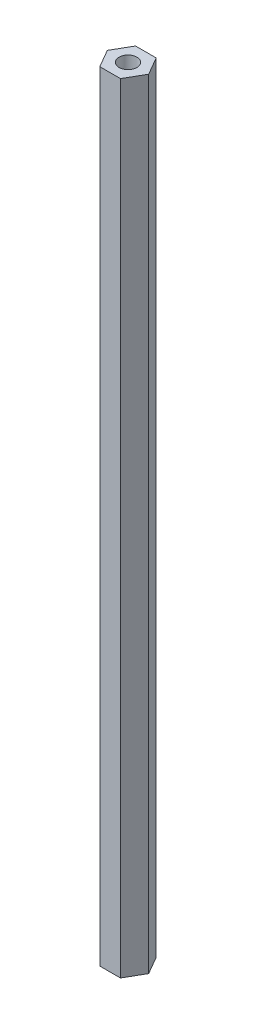
ISO-10303-21;
HEADER;
FILE_DESCRIPTION(('STEP AP214'),'2;1');
FILE_NAME('part.step','',(''),(''),'','','');
FILE_SCHEMA(('AUTOMOTIVE_DESIGN { 1 0 10303 214 1 1 1 1 }'));
ENDSEC;
DATA;
#1=APPLICATION_CONTEXT('core data for automotive mechanical design processes');
#2=APPLICATION_PROTOCOL_DEFINITION('international standard','automotive_design',2000,#1);
#3=PRODUCT_CONTEXT('',#1,'mechanical');
#4=PRODUCT('Part','Part','',(#3));
#5=PRODUCT_RELATED_PRODUCT_CATEGORY('part','',(#4));
#6=PRODUCT_DEFINITION_FORMATION('','',#4);
#7=PRODUCT_DEFINITION_CONTEXT('part definition',#1,'design');
#8=PRODUCT_DEFINITION('design','',#6,#7);
#9=PRODUCT_DEFINITION_SHAPE('','',#8);
#10=(LENGTH_UNIT() NAMED_UNIT(*) SI_UNIT(.MILLI.,.METRE.));
#11=(NAMED_UNIT(*) PLANE_ANGLE_UNIT() SI_UNIT($,.RADIAN.));
#12=(NAMED_UNIT(*) SI_UNIT($,.STERADIAN.) SOLID_ANGLE_UNIT());
#13=UNCERTAINTY_MEASURE_WITH_UNIT(LENGTH_MEASURE(1.E-05),#10,'distance_accuracy_value','');
#14=(GEOMETRIC_REPRESENTATION_CONTEXT(3) GLOBAL_UNCERTAINTY_ASSIGNED_CONTEXT((#13)) GLOBAL_UNIT_ASSIGNED_CONTEXT((#10,
#11,#12)) REPRESENTATION_CONTEXT('',''));
#15=CARTESIAN_POINT('',(0.,0.,0.));
#16=DIRECTION('',(0.,0.,1.));
#17=DIRECTION('',(1.,0.,0.));
#18=AXIS2_PLACEMENT_3D('',#15,#16,#17);
#19=CARTESIAN_POINT('',(2.02072594216369,152.4,-3.5));
#20=DIRECTION('',(0.,0.,1.));
#21=DIRECTION('',(1.,0.,0.));
#22=AXIS2_PLACEMENT_3D('',#19,#20,#21);
#23=PLANE('',#22);
#24=DIRECTION('',(-1.,0.,0.));
#25=VECTOR('',#24,1.);
#26=CARTESIAN_POINT('',(2.02072594216369,0.,-3.5));
#27=LINE('',#26,#25);
#28=CARTESIAN_POINT('',(2.02072594216369,0.,-3.5));
#29=VERTEX_POINT('',#28);
#30=CARTESIAN_POINT('',(-2.02072594216369,0.,-3.5));
#31=VERTEX_POINT('',#30);
#32=EDGE_CURVE('E124',#29,#31,#27,.T.);
#33=ORIENTED_EDGE('',*,*,#32,.T.);
#34=DIRECTION('',(0.,-1.,0.));
#35=VECTOR('',#34,1.);
#36=CARTESIAN_POINT('',(-2.02072594216369,152.4,-3.5));
#37=LINE('',#36,#35);
#38=CARTESIAN_POINT('',(-2.02072594216369,152.4,-3.5));
#39=VERTEX_POINT('',#38);
#40=EDGE_CURVE('E11',#39,#31,#37,.T.);
#41=ORIENTED_EDGE('',*,*,#40,.F.);
#42=DIRECTION('',(-1.,0.,0.));
#43=VECTOR('',#42,1.);
#44=CARTESIAN_POINT('',(2.02072594216369,152.4,-3.5));
#45=LINE('',#44,#43);
#46=CARTESIAN_POINT('',(2.02072594216369,152.4,-3.5));
#47=VERTEX_POINT('',#46);
#48=EDGE_CURVE('E134',#47,#39,#45,.T.);
#49=ORIENTED_EDGE('',*,*,#48,.F.);
#50=DIRECTION('',(0.,-1.,0.));
#51=VECTOR('',#50,1.);
#52=CARTESIAN_POINT('',(2.02072594216369,152.4,-3.5));
#53=LINE('',#52,#51);
#54=EDGE_CURVE('E120',#47,#29,#53,.T.);
#55=ORIENTED_EDGE('',*,*,#54,.T.);
#56=EDGE_LOOP('',(#33,#41,#49,#55));
#57=FACE_BOUND('',#56,.T.);
#58=ADVANCED_FACE('F39',(#57),#23,.F.);
#59=CARTESIAN_POINT('',(-2.02072594216369,152.4,-3.5));
#60=DIRECTION('',(0.866025403784438,0.,0.5));
#61=DIRECTION('',(0.5,0.,-0.866025403784438));
#62=AXIS2_PLACEMENT_3D('',#59,#60,#61);
#63=PLANE('',#62);
#64=DIRECTION('',(-0.5,0.,0.866025403784438));
#65=VECTOR('',#64,1.);
#66=CARTESIAN_POINT('',(-2.02072594216369,0.,-3.5));
#67=LINE('',#66,#65);
#68=CARTESIAN_POINT('',(-4.04145188432738,0.,0.));
#69=VERTEX_POINT('',#68);
#70=EDGE_CURVE('E127',#31,#69,#67,.T.);
#71=ORIENTED_EDGE('',*,*,#70,.T.);
#72=DIRECTION('',(0.,-1.,0.));
#73=VECTOR('',#72,1.);
#74=CARTESIAN_POINT('',(-4.04145188432738,152.4,0.));
#75=LINE('',#74,#73);
#76=CARTESIAN_POINT('',(-4.04145188432738,152.4,0.));
#77=VERTEX_POINT('',#76);
#78=EDGE_CURVE('E48',#77,#69,#75,.T.);
#79=ORIENTED_EDGE('',*,*,#78,.F.);
#80=DIRECTION('',(-0.5,0.,0.866025403784438));
#81=VECTOR('',#80,1.);
#82=CARTESIAN_POINT('',(-2.02072594216369,152.4,-3.5));
#83=LINE('',#82,#81);
#84=EDGE_CURVE('E93',#39,#77,#83,.T.);
#85=ORIENTED_EDGE('',*,*,#84,.F.);
#86=ORIENTED_EDGE('',*,*,#40,.T.);
#87=EDGE_LOOP('',(#71,#79,#85,#86));
#88=FACE_BOUND('',#87,.T.);
#89=ADVANCED_FACE('F160',(#88),#63,.F.);
#90=CARTESIAN_POINT('',(-4.04145188432738,152.4,0.));
#91=DIRECTION('',(0.866025403784439,0.,-0.5));
#92=DIRECTION('',(-0.5,0.,-0.866025403784439));
#93=AXIS2_PLACEMENT_3D('',#90,#91,#92);
#94=PLANE('',#93);
#95=DIRECTION('',(0.5,0.,0.866025403784439));
#96=VECTOR('',#95,1.);
#97=CARTESIAN_POINT('',(-4.04145188432738,0.,0.));
#98=LINE('',#97,#96);
#99=CARTESIAN_POINT('',(-2.02072594216369,0.,3.5));
#100=VERTEX_POINT('',#99);
#101=EDGE_CURVE('E129',#69,#100,#98,.T.);
#102=ORIENTED_EDGE('',*,*,#101,.T.);
#103=DIRECTION('',(0.,-1.,0.));
#104=VECTOR('',#103,1.);
#105=CARTESIAN_POINT('',(-2.02072594216369,152.4,3.5));
#106=LINE('',#105,#104);
#107=CARTESIAN_POINT('',(-2.02072594216369,152.4,3.5));
#108=VERTEX_POINT('',#107);
#109=EDGE_CURVE('E115',#108,#100,#106,.T.);
#110=ORIENTED_EDGE('',*,*,#109,.F.);
#111=DIRECTION('',(0.5,0.,0.866025403784439));
#112=VECTOR('',#111,1.);
#113=CARTESIAN_POINT('',(-4.04145188432738,152.4,0.));
#114=LINE('',#113,#112);
#115=EDGE_CURVE('E106',#77,#108,#114,.T.);
#116=ORIENTED_EDGE('',*,*,#115,.F.);
#117=ORIENTED_EDGE('',*,*,#78,.T.);
#118=EDGE_LOOP('',(#102,#110,#116,#117));
#119=FACE_BOUND('',#118,.T.);
#120=ADVANCED_FACE('F141',(#119),#94,.F.);
#121=CARTESIAN_POINT('',(-2.02072594216369,152.4,3.5));
#122=DIRECTION('',(0.,0.,-1.));
#123=DIRECTION('',(-1.,0.,0.));
#124=AXIS2_PLACEMENT_3D('',#121,#122,#123);
#125=PLANE('',#124);
#126=DIRECTION('',(1.,0.,0.));
#127=VECTOR('',#126,1.);
#128=CARTESIAN_POINT('',(-2.02072594216369,0.,3.5));
#129=LINE('',#128,#127);
#130=CARTESIAN_POINT('',(2.02072594216369,0.,3.5));
#131=VERTEX_POINT('',#130);
#132=EDGE_CURVE('E114',#100,#131,#129,.T.);
#133=ORIENTED_EDGE('',*,*,#132,.T.);
#134=DIRECTION('',(0.,-1.,0.));
#135=VECTOR('',#134,1.);
#136=CARTESIAN_POINT('',(2.02072594216369,152.4,3.5));
#137=LINE('',#136,#135);
#138=CARTESIAN_POINT('',(2.02072594216369,152.4,3.5));
#139=VERTEX_POINT('',#138);
#140=EDGE_CURVE('E111',#139,#131,#137,.T.);
#141=ORIENTED_EDGE('',*,*,#140,.F.);
#142=DIRECTION('',(1.,0.,0.));
#143=VECTOR('',#142,1.);
#144=CARTESIAN_POINT('',(-2.02072594216369,152.4,3.5));
#145=LINE('',#144,#143);
#146=EDGE_CURVE('E100',#108,#139,#145,.T.);
#147=ORIENTED_EDGE('',*,*,#146,.F.);
#148=ORIENTED_EDGE('',*,*,#109,.T.);
#149=EDGE_LOOP('',(#133,#141,#147,#148));
#150=FACE_BOUND('',#149,.T.);
#151=ADVANCED_FACE('F112',(#150),#125,.F.);
#152=CARTESIAN_POINT('',(2.02072594216369,152.4,3.5));
#153=DIRECTION('',(-0.866025403784439,0.,-0.5));
#154=DIRECTION('',(-0.5,0.,0.866025403784439));
#155=AXIS2_PLACEMENT_3D('',#152,#153,#154);
#156=PLANE('',#155);
#157=DIRECTION('',(0.5,0.,-0.866025403784439));
#158=VECTOR('',#157,1.);
#159=CARTESIAN_POINT('',(2.02072594216369,0.,3.5));
#160=LINE('',#159,#158);
#161=CARTESIAN_POINT('',(4.04145188432738,0.,0.));
#162=VERTEX_POINT('',#161);
#163=EDGE_CURVE('E79',#131,#162,#160,.T.);
#164=ORIENTED_EDGE('',*,*,#163,.T.);
#165=DIRECTION('',(0.,-1.,0.));
#166=VECTOR('',#165,1.);
#167=CARTESIAN_POINT('',(4.04145188432738,152.4,0.));
#168=LINE('',#167,#166);
#169=CARTESIAN_POINT('',(4.04145188432738,152.4,0.));
#170=VERTEX_POINT('',#169);
#171=EDGE_CURVE('E116',#170,#162,#168,.T.);
#172=ORIENTED_EDGE('',*,*,#171,.F.);
#173=DIRECTION('',(0.5,0.,-0.866025403784439));
#174=VECTOR('',#173,1.);
#175=CARTESIAN_POINT('',(2.02072594216369,152.4,3.5));
#176=LINE('',#175,#174);
#177=EDGE_CURVE('E104',#139,#170,#176,.T.);
#178=ORIENTED_EDGE('',*,*,#177,.F.);
#179=ORIENTED_EDGE('',*,*,#140,.T.);
#180=EDGE_LOOP('',(#164,#172,#178,#179));
#181=FACE_BOUND('',#180,.T.);
#182=ADVANCED_FACE('F118',(#181),#156,.F.);
#183=CARTESIAN_POINT('',(4.04145188432738,152.4,0.));
#184=DIRECTION('',(-0.866025403784439,0.,0.5));
#185=DIRECTION('',(0.5,0.,0.866025403784439));
#186=AXIS2_PLACEMENT_3D('',#183,#184,#185);
#187=PLANE('',#186);
#188=DIRECTION('',(-0.5,0.,-0.866025403784439));
#189=VECTOR('',#188,1.);
#190=CARTESIAN_POINT('',(4.04145188432738,0.,0.));
#191=LINE('',#190,#189);
#192=EDGE_CURVE('E85',#162,#29,#191,.T.);
#193=ORIENTED_EDGE('',*,*,#192,.T.);
#194=ORIENTED_EDGE('',*,*,#54,.F.);
#195=DIRECTION('',(-0.5,0.,-0.866025403784439));
#196=VECTOR('',#195,1.);
#197=CARTESIAN_POINT('',(4.04145188432738,152.4,0.));
#198=LINE('',#197,#196);
#199=EDGE_CURVE('E56',#170,#47,#198,.T.);
#200=ORIENTED_EDGE('',*,*,#199,.F.);
#201=ORIENTED_EDGE('',*,*,#171,.T.);
#202=EDGE_LOOP('',(#193,#194,#200,#201));
#203=FACE_BOUND('',#202,.T.);
#204=ADVANCED_FACE('F148',(#203),#187,.F.);
#205=CARTESIAN_POINT('',(0.,152.4,0.));
#206=DIRECTION('',(0.,1.,0.));
#207=DIRECTION('',(0.,0.,1.));
#208=AXIS2_PLACEMENT_3D('',#205,#206,#207);
#209=PLANE('',#208);
#210=CARTESIAN_POINT('',(0.,152.4,0.));
#211=DIRECTION('',(0.,1.,0.));
#212=DIRECTION('',(0.,0.,1.));
#213=AXIS2_PLACEMENT_3D('',#210,#211,#212);
#214=CIRCLE('',#213,1.75);
#215=CARTESIAN_POINT('',(0.,152.4,1.75));
#216=VERTEX_POINT('',#215);
#217=EDGE_CURVE('E214',#216,#216,#214,.T.);
#218=ORIENTED_EDGE('',*,*,#217,.F.);
#219=EDGE_LOOP('',(#218));
#220=FACE_BOUND('',#219,.T.);
#221=ORIENTED_EDGE('',*,*,#48,.T.);
#222=ORIENTED_EDGE('',*,*,#84,.T.);
#223=ORIENTED_EDGE('',*,*,#115,.T.);
#224=ORIENTED_EDGE('',*,*,#146,.T.);
#225=ORIENTED_EDGE('',*,*,#177,.T.);
#226=ORIENTED_EDGE('',*,*,#199,.T.);
#227=EDGE_LOOP('',(#221,#222,#223,#224,#225,#226));
#228=FACE_BOUND('',#227,.T.);
#229=ADVANCED_FACE('F102',(#220,#228),#209,.T.);
#230=CARTESIAN_POINT('',(0.,0.,0.));
#231=DIRECTION('',(0.,1.,0.));
#232=DIRECTION('',(0.,0.,1.));
#233=AXIS2_PLACEMENT_3D('',#230,#231,#232);
#234=PLANE('',#233);
#235=CARTESIAN_POINT('',(0.,0.,0.));
#236=DIRECTION('',(0.,1.,0.));
#237=DIRECTION('',(0.,0.,1.));
#238=AXIS2_PLACEMENT_3D('',#235,#236,#237);
#239=CIRCLE('',#238,1.75);
#240=CARTESIAN_POINT('',(0.,0.,1.75));
#241=VERTEX_POINT('',#240);
#242=EDGE_CURVE('E42',#241,#241,#239,.T.);
#243=ORIENTED_EDGE('',*,*,#242,.T.);
#244=EDGE_LOOP('',(#243));
#245=FACE_BOUND('',#244,.T.);
#246=ORIENTED_EDGE('',*,*,#32,.F.);
#247=ORIENTED_EDGE('',*,*,#192,.F.);
#248=ORIENTED_EDGE('',*,*,#163,.F.);
#249=ORIENTED_EDGE('',*,*,#132,.F.);
#250=ORIENTED_EDGE('',*,*,#101,.F.);
#251=ORIENTED_EDGE('',*,*,#70,.F.);
#252=EDGE_LOOP('',(#246,#247,#248,#249,#250,#251));
#253=FACE_BOUND('',#252,.T.);
#254=ADVANCED_FACE('F144',(#245,#253),#234,.F.);
#255=CARTESIAN_POINT('',(0.,-1847.6,0.));
#256=DIRECTION('',(0.,1.,0.));
#257=DIRECTION('',(0.,0.,1.));
#258=AXIS2_PLACEMENT_3D('',#255,#256,#257);
#259=CYLINDRICAL_SURFACE('',#258,1.75);
#260=ORIENTED_EDGE('',*,*,#217,.T.);
#261=EDGE_LOOP('',(#260));
#262=FACE_BOUND('',#261,.T.);
#263=ORIENTED_EDGE('',*,*,#242,.F.);
#264=EDGE_LOOP('',(#263));
#265=FACE_BOUND('',#264,.T.);
#266=ADVANCED_FACE('F199',(#262,#265),#259,.F.);
#267=CLOSED_SHELL('',(#58,#89,#120,#151,#182,#204,#229,#254,#266));
#268=MANIFOLD_SOLID_BREP('B2',#267);
#269=ADVANCED_BREP_SHAPE_REPRESENTATION('',(#18,#268),#14);
#270=SHAPE_DEFINITION_REPRESENTATION(#9,#269);
ENDSEC;
END-ISO-10303-21;
